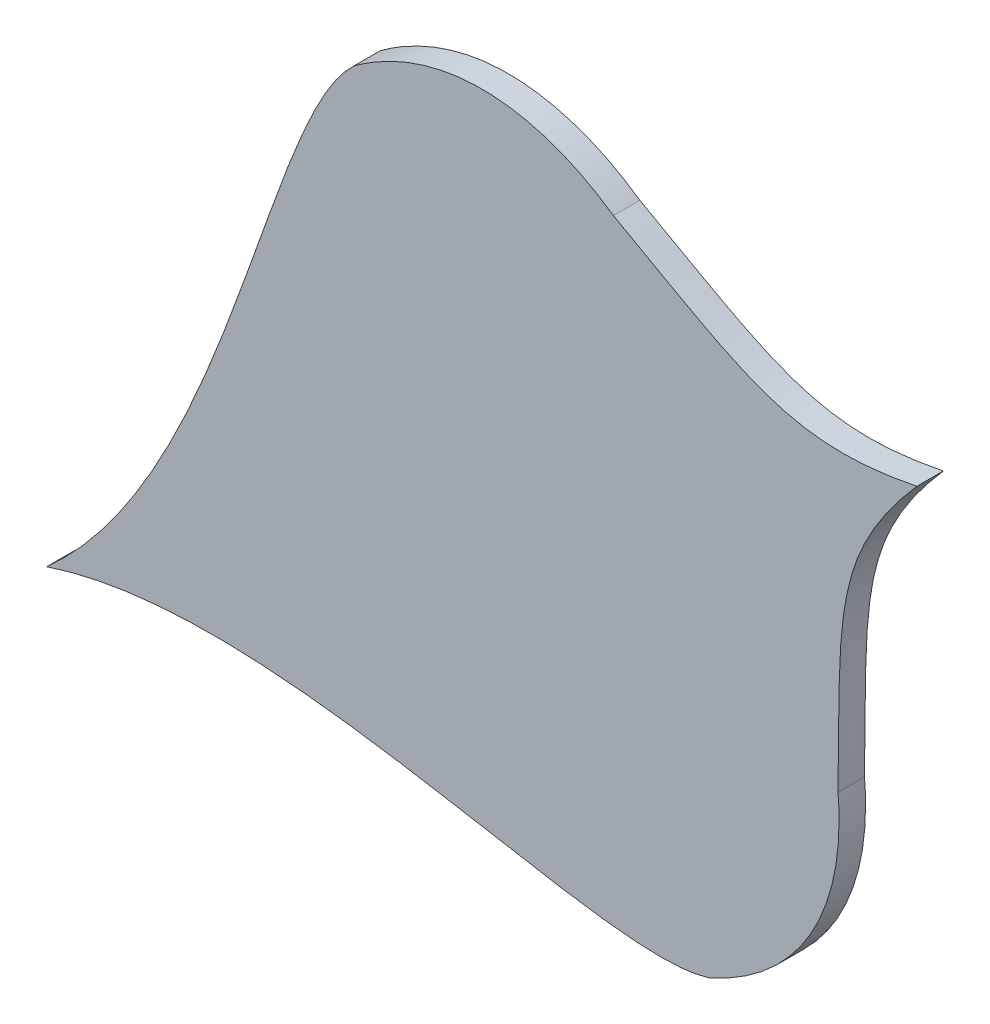
ISO-10303-21;
HEADER;
FILE_DESCRIPTION(('STEP AP214'),'2;1');
FILE_NAME('part.step','',(''),(''),'','','');
FILE_SCHEMA(('AUTOMOTIVE_DESIGN { 1 0 10303 214 1 1 1 1 }'));
ENDSEC;
DATA;
#1=APPLICATION_CONTEXT('core data for automotive mechanical design processes');
#2=APPLICATION_PROTOCOL_DEFINITION('international standard','automotive_design',2000,#1);
#3=PRODUCT_CONTEXT('',#1,'mechanical');
#4=PRODUCT('Part','Part','',(#3));
#5=PRODUCT_RELATED_PRODUCT_CATEGORY('part','',(#4));
#6=PRODUCT_DEFINITION_FORMATION('','',#4);
#7=PRODUCT_DEFINITION_CONTEXT('part definition',#1,'design');
#8=PRODUCT_DEFINITION('design','',#6,#7);
#9=PRODUCT_DEFINITION_SHAPE('','',#8);
#10=(LENGTH_UNIT() NAMED_UNIT(*) SI_UNIT(.MILLI.,.METRE.));
#11=(NAMED_UNIT(*) PLANE_ANGLE_UNIT() SI_UNIT($,.RADIAN.));
#12=(NAMED_UNIT(*) SI_UNIT($,.STERADIAN.) SOLID_ANGLE_UNIT());
#13=UNCERTAINTY_MEASURE_WITH_UNIT(LENGTH_MEASURE(1.E-05),#10,'distance_accuracy_value','');
#14=(GEOMETRIC_REPRESENTATION_CONTEXT(3) GLOBAL_UNCERTAINTY_ASSIGNED_CONTEXT((#13)) GLOBAL_UNIT_ASSIGNED_CONTEXT((#10,
#11,#12)) REPRESENTATION_CONTEXT('',''));
#15=CARTESIAN_POINT('',(0.,0.,0.));
#16=DIRECTION('',(0.,0.,1.));
#17=DIRECTION('',(1.,0.,0.));
#18=AXIS2_PLACEMENT_3D('',#15,#16,#17);
#19=CARTESIAN_POINT('',(1386.00281678721,916.104507470031,10.));
#20=CARTESIAN_POINT('',(1386.87003880635,973.589282342473,10.));
#21=CARTESIAN_POINT('',(1383.43934044321,994.07954089172,10.));
#22=CARTESIAN_POINT('',(1415.76937980031,1031.04683558084,10.));
#23=B_SPLINE_CURVE_WITH_KNOTS('',3,(#19,#20,#21,#22),.UNSPECIFIED.,.F.,.F.,(4,4),(0.,1.),.UNSPECIFIED.);
#24=DIRECTION('',(0.,0.,-1.));
#25=VECTOR('',#24,1.);
#26=SURFACE_OF_LINEAR_EXTRUSION('',#23,#25);
#27=CARTESIAN_POINT('',(1386.00281678721,916.104507470031,0.));
#28=CARTESIAN_POINT('',(1386.87003880635,973.589282342473,0.));
#29=CARTESIAN_POINT('',(1383.43934044321,994.07954089172,0.));
#30=CARTESIAN_POINT('',(1415.76937980031,1031.04683558084,0.));
#31=B_SPLINE_CURVE_WITH_KNOTS('',3,(#27,#28,#29,#30),.UNSPECIFIED.,.F.,.F.,(4,4),(0.,1.),.UNSPECIFIED.);
#32=CARTESIAN_POINT('',(1386.00281678721,916.104507470031,0.));
#33=VERTEX_POINT('',#32);
#34=CARTESIAN_POINT('',(1415.76937980031,1031.04683558084,0.));
#35=VERTEX_POINT('',#34);
#36=EDGE_CURVE('E185',#33,#35,#31,.T.);
#37=ORIENTED_EDGE('',*,*,#36,.T.);
#38=DIRECTION('',(0.,0.,-1.));
#39=VECTOR('',#38,1.);
#40=CARTESIAN_POINT('',(1415.76937980031,1031.04683558084,10.));
#41=LINE('',#40,#39);
#42=CARTESIAN_POINT('',(1415.76937980031,1031.04683558084,10.));
#43=VERTEX_POINT('',#42);
#44=EDGE_CURVE('E11',#43,#35,#41,.T.);
#45=ORIENTED_EDGE('',*,*,#44,.F.);
#46=CARTESIAN_POINT('',(1386.00281678721,916.104507470031,10.));
#47=VERTEX_POINT('',#46);
#48=EDGE_CURVE('E152',#47,#43,#23,.T.);
#49=ORIENTED_EDGE('',*,*,#48,.F.);
#50=DIRECTION('',(0.,0.,-1.));
#51=VECTOR('',#50,1.);
#52=CARTESIAN_POINT('',(1386.00281678721,916.104507470031,10.));
#53=LINE('',#52,#51);
#54=EDGE_CURVE('E114',#47,#33,#53,.T.);
#55=ORIENTED_EDGE('',*,*,#54,.T.);
#56=EDGE_LOOP('',(#37,#45,#49,#55));
#57=FACE_BOUND('',#56,.T.);
#58=ADVANCED_FACE('F33',(#57),#26,.F.);
#59=CARTESIAN_POINT('',(1415.76937980031,1031.04683558084,10.));
#60=CARTESIAN_POINT('',(1367.6282103111,1021.3391004343,10.));
#61=CARTESIAN_POINT('',(1351.54570989469,1034.49104200313,10.));
#62=CARTESIAN_POINT('',(1301.21719941955,1062.28119222797,10.));
#63=B_SPLINE_CURVE_WITH_KNOTS('',3,(#59,#60,#61,#62),.UNSPECIFIED.,.F.,.F.,(4,4),(0.,1.),.UNSPECIFIED.);
#64=DIRECTION('',(0.,0.,-1.));
#65=VECTOR('',#64,1.);
#66=SURFACE_OF_LINEAR_EXTRUSION('',#63,#65);
#67=CARTESIAN_POINT('',(1415.76937980031,1031.04683558084,0.));
#68=CARTESIAN_POINT('',(1367.6282103111,1021.3391004343,0.));
#69=CARTESIAN_POINT('',(1351.54570989469,1034.49104200313,0.));
#70=CARTESIAN_POINT('',(1301.21719941955,1062.28119222797,0.));
#71=B_SPLINE_CURVE_WITH_KNOTS('',3,(#67,#68,#69,#70),.UNSPECIFIED.,.F.,.F.,(4,4),(0.,1.),.UNSPECIFIED.);
#72=CARTESIAN_POINT('',(1301.21719941955,1062.28119222797,0.));
#73=VERTEX_POINT('',#72);
#74=EDGE_CURVE('E183',#35,#73,#71,.T.);
#75=ORIENTED_EDGE('',*,*,#74,.T.);
#76=DIRECTION('',(0.,0.,-1.));
#77=VECTOR('',#76,1.);
#78=CARTESIAN_POINT('',(1301.21719941955,1062.28119222797,10.));
#79=LINE('',#78,#77);
#80=CARTESIAN_POINT('',(1301.21719941955,1062.28119222797,10.));
#81=VERTEX_POINT('',#80);
#82=EDGE_CURVE('E42',#81,#73,#79,.T.);
#83=ORIENTED_EDGE('',*,*,#82,.F.);
#84=EDGE_CURVE('E87',#43,#81,#63,.T.);
#85=ORIENTED_EDGE('',*,*,#84,.F.);
#86=ORIENTED_EDGE('',*,*,#44,.T.);
#87=EDGE_LOOP('',(#75,#83,#85,#86));
#88=FACE_BOUND('',#87,.T.);
#89=ADVANCED_FACE('F140',(#88),#66,.F.);
#90=CARTESIAN_POINT('',(1301.21719941955,1062.28119222797,10.));
#91=CARTESIAN_POINT('',(1274.48547389704,1081.01765005384,10.));
#92=CARTESIAN_POINT('',(1237.92294125638,1087.54067810317,10.));
#93=CARTESIAN_POINT('',(1203.28477393615,1062.2882902757,10.));
#94=B_SPLINE_CURVE_WITH_KNOTS('',3,(#90,#91,#92,#93),.UNSPECIFIED.,.F.,.F.,(4,4),(0.,1.),.UNSPECIFIED.);
#95=DIRECTION('',(0.,0.,-1.));
#96=VECTOR('',#95,1.);
#97=SURFACE_OF_LINEAR_EXTRUSION('',#94,#96);
#98=CARTESIAN_POINT('',(1301.21719941955,1062.28119222797,0.));
#99=CARTESIAN_POINT('',(1274.48547389704,1081.01765005384,0.));
#100=CARTESIAN_POINT('',(1237.92294125638,1087.54067810317,0.));
#101=CARTESIAN_POINT('',(1203.28477393615,1062.2882902757,0.));
#102=B_SPLINE_CURVE_WITH_KNOTS('',3,(#98,#99,#100,#101),.UNSPECIFIED.,.F.,.F.,(4,4),(0.,1.),.UNSPECIFIED.);
#103=CARTESIAN_POINT('',(1203.28477393615,1062.2882902757,0.));
#104=VERTEX_POINT('',#103);
#105=EDGE_CURVE('E179',#73,#104,#102,.T.);
#106=ORIENTED_EDGE('',*,*,#105,.T.);
#107=DIRECTION('',(0.,0.,-1.));
#108=VECTOR('',#107,1.);
#109=CARTESIAN_POINT('',(1203.28477393615,1062.2882902757,10.));
#110=LINE('',#109,#108);
#111=CARTESIAN_POINT('',(1203.28477393615,1062.2882902757,10.));
#112=VERTEX_POINT('',#111);
#113=EDGE_CURVE('E109',#112,#104,#110,.T.);
#114=ORIENTED_EDGE('',*,*,#113,.F.);
#115=EDGE_CURVE('E100',#81,#112,#94,.T.);
#116=ORIENTED_EDGE('',*,*,#115,.F.);
#117=ORIENTED_EDGE('',*,*,#82,.T.);
#118=EDGE_LOOP('',(#106,#114,#116,#117));
#119=FACE_BOUND('',#118,.T.);
#120=ADVANCED_FACE('F138',(#119),#97,.F.);
#121=CARTESIAN_POINT('',(1203.28477393615,1062.2882902757,10.));
#122=CARTESIAN_POINT('',(1170.19836860168,1031.59893422355,10.));
#123=CARTESIAN_POINT('',(1156.25701217779,901.986996511216,10.));
#124=CARTESIAN_POINT('',(1087.2493397633,840.498155000835,10.));
#125=B_SPLINE_CURVE_WITH_KNOTS('',3,(#121,#122,#123,#124),.UNSPECIFIED.,.F.,.F.,(4,4),(0.,1.),.UNSPECIFIED.);
#126=DIRECTION('',(0.,0.,-1.));
#127=VECTOR('',#126,1.);
#128=SURFACE_OF_LINEAR_EXTRUSION('',#125,#127);
#129=CARTESIAN_POINT('',(1203.28477393615,1062.2882902757,0.));
#130=CARTESIAN_POINT('',(1170.19836860168,1031.59893422355,0.));
#131=CARTESIAN_POINT('',(1156.25701217779,901.986996511216,0.));
#132=CARTESIAN_POINT('',(1087.2493397633,840.498155000835,0.));
#133=B_SPLINE_CURVE_WITH_KNOTS('',3,(#129,#130,#131,#132),.UNSPECIFIED.,.F.,.F.,(4,4),(0.,1.),.UNSPECIFIED.);
#134=CARTESIAN_POINT('',(1087.2493397633,840.498155000835,0.));
#135=VERTEX_POINT('',#134);
#136=EDGE_CURVE('E108',#104,#135,#133,.T.);
#137=ORIENTED_EDGE('',*,*,#136,.T.);
#138=DIRECTION('',(0.,0.,-1.));
#139=VECTOR('',#138,1.);
#140=CARTESIAN_POINT('',(1087.2493397633,840.498155000835,10.));
#141=LINE('',#140,#139);
#142=CARTESIAN_POINT('',(1087.2493397633,840.498155000835,10.));
#143=VERTEX_POINT('',#142);
#144=EDGE_CURVE('E105',#143,#135,#141,.T.);
#145=ORIENTED_EDGE('',*,*,#144,.F.);
#146=EDGE_CURVE('E94',#112,#143,#125,.T.);
#147=ORIENTED_EDGE('',*,*,#146,.F.);
#148=ORIENTED_EDGE('',*,*,#113,.T.);
#149=EDGE_LOOP('',(#137,#145,#147,#148));
#150=FACE_BOUND('',#149,.T.);
#151=ADVANCED_FACE('F106',(#150),#128,.F.);
#152=CARTESIAN_POINT('',(1087.2493397633,840.498155000835,10.));
#153=CARTESIAN_POINT('',(1174.88723696067,869.867108968872,10.));
#154=CARTESIAN_POINT('',(1294.31523534211,817.612262121069,10.));
#155=CARTESIAN_POINT('',(1337.38258973499,831.093722666951,10.));
#156=B_SPLINE_CURVE_WITH_KNOTS('',3,(#152,#153,#154,#155),.UNSPECIFIED.,.F.,.F.,(4,4),(0.,1.),.UNSPECIFIED.);
#157=DIRECTION('',(0.,0.,-1.));
#158=VECTOR('',#157,1.);
#159=SURFACE_OF_LINEAR_EXTRUSION('',#156,#158);
#160=CARTESIAN_POINT('',(1087.2493397633,840.498155000835,0.));
#161=CARTESIAN_POINT('',(1174.88723696067,869.867108968872,0.));
#162=CARTESIAN_POINT('',(1294.31523534211,817.612262121069,0.));
#163=CARTESIAN_POINT('',(1337.38258973499,831.093722666951,0.));
#164=B_SPLINE_CURVE_WITH_KNOTS('',3,(#160,#161,#162,#163),.UNSPECIFIED.,.F.,.F.,(4,4),(0.,1.),.UNSPECIFIED.);
#165=CARTESIAN_POINT('',(1337.38258973499,831.093722666951,0.));
#166=VERTEX_POINT('',#165);
#167=EDGE_CURVE('E73',#135,#166,#164,.T.);
#168=ORIENTED_EDGE('',*,*,#167,.T.);
#169=DIRECTION('',(0.,0.,-1.));
#170=VECTOR('',#169,1.);
#171=CARTESIAN_POINT('',(1337.38258973499,831.093722666951,10.));
#172=LINE('',#171,#170);
#173=CARTESIAN_POINT('',(1337.38258973499,831.093722666951,10.));
#174=VERTEX_POINT('',#173);
#175=EDGE_CURVE('E110',#174,#166,#172,.T.);
#176=ORIENTED_EDGE('',*,*,#175,.F.);
#177=EDGE_CURVE('E98',#143,#174,#156,.T.);
#178=ORIENTED_EDGE('',*,*,#177,.F.);
#179=ORIENTED_EDGE('',*,*,#144,.T.);
#180=EDGE_LOOP('',(#168,#176,#178,#179));
#181=FACE_BOUND('',#180,.T.);
#182=ADVANCED_FACE('F112',(#181),#159,.F.);
#183=CARTESIAN_POINT('',(1337.38258973499,831.093722666951,10.));
#184=CARTESIAN_POINT('',(1376.50104578353,848.62176085359,10.));
#185=CARTESIAN_POINT('',(1388.99332460947,883.597633362596,10.));
#186=CARTESIAN_POINT('',(1386.00281678721,916.104507470031,10.));
#187=B_SPLINE_CURVE_WITH_KNOTS('',3,(#183,#184,#185,#186),.UNSPECIFIED.,.F.,.F.,(4,4),(0.,1.),.UNSPECIFIED.);
#188=DIRECTION('',(0.,0.,-1.));
#189=VECTOR('',#188,1.);
#190=SURFACE_OF_LINEAR_EXTRUSION('',#187,#189);
#191=CARTESIAN_POINT('',(1337.38258973499,831.093722666951,0.));
#192=CARTESIAN_POINT('',(1376.50104578353,848.62176085359,0.));
#193=CARTESIAN_POINT('',(1388.99332460947,883.597633362596,0.));
#194=CARTESIAN_POINT('',(1386.00281678721,916.104507470031,0.));
#195=B_SPLINE_CURVE_WITH_KNOTS('',3,(#191,#192,#193,#194),.UNSPECIFIED.,.F.,.F.,(4,4),(0.,1.),.UNSPECIFIED.);
#196=EDGE_CURVE('E79',#166,#33,#195,.T.);
#197=ORIENTED_EDGE('',*,*,#196,.T.);
#198=ORIENTED_EDGE('',*,*,#54,.F.);
#199=EDGE_CURVE('E50',#174,#47,#187,.T.);
#200=ORIENTED_EDGE('',*,*,#199,.F.);
#201=ORIENTED_EDGE('',*,*,#175,.T.);
#202=EDGE_LOOP('',(#197,#198,#200,#201));
#203=FACE_BOUND('',#202,.T.);
#204=ADVANCED_FACE('F134',(#203),#190,.F.);
#205=CARTESIAN_POINT('',(1389.08754179202,981.269726594181,10.));
#206=DIRECTION('',(0.,0.,-1.));
#207=DIRECTION('',(-1.,0.,0.));
#208=AXIS2_PLACEMENT_3D('',#205,#206,#207);
#209=PLANE('',#208);
#210=ORIENTED_EDGE('',*,*,#48,.T.);
#211=ORIENTED_EDGE('',*,*,#84,.T.);
#212=ORIENTED_EDGE('',*,*,#115,.T.);
#213=ORIENTED_EDGE('',*,*,#146,.T.);
#214=ORIENTED_EDGE('',*,*,#177,.T.);
#215=ORIENTED_EDGE('',*,*,#199,.T.);
#216=EDGE_LOOP('',(#210,#211,#212,#213,#214,#215));
#217=FACE_BOUND('',#216,.T.);
#218=ADVANCED_FACE('F96',(#217),#209,.F.);
#219=CARTESIAN_POINT('',(1389.08754179202,981.269726594181,0.));
#220=DIRECTION('',(0.,0.,-1.));
#221=DIRECTION('',(-1.,0.,0.));
#222=AXIS2_PLACEMENT_3D('',#219,#220,#221);
#223=PLANE('',#222);
#224=ORIENTED_EDGE('',*,*,#36,.F.);
#225=ORIENTED_EDGE('',*,*,#196,.F.);
#226=ORIENTED_EDGE('',*,*,#167,.F.);
#227=ORIENTED_EDGE('',*,*,#136,.F.);
#228=ORIENTED_EDGE('',*,*,#105,.F.);
#229=ORIENTED_EDGE('',*,*,#74,.F.);
#230=EDGE_LOOP('',(#224,#225,#226,#227,#228,#229));
#231=FACE_BOUND('',#230,.T.);
#232=ADVANCED_FACE('F182',(#231),#223,.T.);
#233=CLOSED_SHELL('',(#58,#89,#120,#151,#182,#204,#218,#232));
#234=MANIFOLD_SOLID_BREP('B2',#233);
#235=ADVANCED_BREP_SHAPE_REPRESENTATION('',(#18,#234),#14);
#236=SHAPE_DEFINITION_REPRESENTATION(#9,#235);
ENDSEC;
END-ISO-10303-21;
